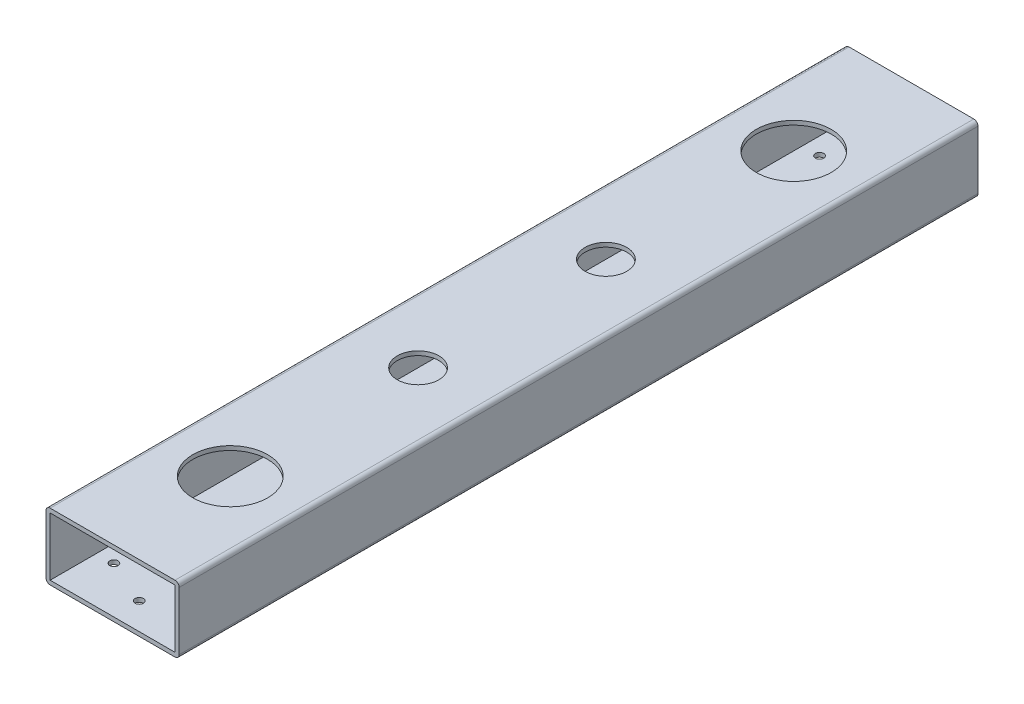
ISO-10303-21;
HEADER;
FILE_DESCRIPTION(('STEP AP214'),'2;1');
FILE_NAME('part.step','',(''),(''),'','','');
FILE_SCHEMA(('AUTOMOTIVE_DESIGN { 1 0 10303 214 1 1 1 1 }'));
ENDSEC;
DATA;
#1=APPLICATION_CONTEXT('core data for automotive mechanical design processes');
#2=APPLICATION_PROTOCOL_DEFINITION('international standard','automotive_design',2000,#1);
#3=PRODUCT_CONTEXT('',#1,'mechanical');
#4=PRODUCT('Part','Part','',(#3));
#5=PRODUCT_RELATED_PRODUCT_CATEGORY('part','',(#4));
#6=PRODUCT_DEFINITION_FORMATION('','',#4);
#7=PRODUCT_DEFINITION_CONTEXT('part definition',#1,'design');
#8=PRODUCT_DEFINITION('design','',#6,#7);
#9=PRODUCT_DEFINITION_SHAPE('','',#8);
#10=(LENGTH_UNIT() NAMED_UNIT(*) SI_UNIT(.MILLI.,.METRE.));
#11=(NAMED_UNIT(*) PLANE_ANGLE_UNIT() SI_UNIT($,.RADIAN.));
#12=(NAMED_UNIT(*) SI_UNIT($,.STERADIAN.) SOLID_ANGLE_UNIT());
#13=UNCERTAINTY_MEASURE_WITH_UNIT(LENGTH_MEASURE(1.E-05),#10,'distance_accuracy_value','');
#14=(GEOMETRIC_REPRESENTATION_CONTEXT(3) GLOBAL_UNCERTAINTY_ASSIGNED_CONTEXT((#13)) GLOBAL_UNIT_ASSIGNED_CONTEXT((#10,
#11,#12)) REPRESENTATION_CONTEXT('',''));
#15=CARTESIAN_POINT('',(0.,0.,0.));
#16=DIRECTION('',(0.,0.,1.));
#17=DIRECTION('',(1.,0.,0.));
#18=AXIS2_PLACEMENT_3D('',#15,#16,#17);
#19=CARTESIAN_POINT('',(-23.8125,-11.1125,304.8));
#20=DIRECTION('',(0.,0.,-1.));
#21=DIRECTION('',(-1.,0.,0.));
#22=AXIS2_PLACEMENT_3D('',#19,#20,#21);
#23=PLANE('',#22);
#24=CARTESIAN_POINT('',(-23.8125,-11.1125,304.8));
#25=DIRECTION('',(0.,0.,1.));
#26=DIRECTION('',(-1.,0.,0.));
#27=AXIS2_PLACEMENT_3D('',#24,#25,#26);
#28=CIRCLE('',#27,1.5875);
#29=CARTESIAN_POINT('',(-25.4,-11.1125,304.8));
#30=VERTEX_POINT('',#29);
#31=CARTESIAN_POINT('',(-23.8125,-12.7,304.8));
#32=VERTEX_POINT('',#31);
#33=EDGE_CURVE('E160',#30,#32,#28,.T.);
#34=ORIENTED_EDGE('',*,*,#33,.T.);
#35=DIRECTION('',(1.,0.,0.));
#36=VECTOR('',#35,1.);
#37=CARTESIAN_POINT('',(-23.8125,-12.7,304.8));
#38=LINE('',#37,#36);
#39=CARTESIAN_POINT('',(23.8125,-12.7,304.8));
#40=VERTEX_POINT('',#39);
#41=EDGE_CURVE('E163',#32,#40,#38,.T.);
#42=ORIENTED_EDGE('',*,*,#41,.T.);
#43=CARTESIAN_POINT('',(23.8125,-11.1125,304.8));
#44=DIRECTION('',(0.,0.,1.));
#45=DIRECTION('',(1.,0.,0.));
#46=AXIS2_PLACEMENT_3D('',#43,#44,#45);
#47=CIRCLE('',#46,1.5875);
#48=CARTESIAN_POINT('',(25.4,-11.1125,304.8));
#49=VERTEX_POINT('',#48);
#50=EDGE_CURVE('E166',#40,#49,#47,.T.);
#51=ORIENTED_EDGE('',*,*,#50,.T.);
#52=DIRECTION('',(0.,1.,0.));
#53=VECTOR('',#52,1.);
#54=CARTESIAN_POINT('',(25.4,-11.1125,304.8));
#55=LINE('',#54,#53);
#56=CARTESIAN_POINT('',(25.4,11.1125,304.8));
#57=VERTEX_POINT('',#56);
#58=EDGE_CURVE('E168',#49,#57,#55,.T.);
#59=ORIENTED_EDGE('',*,*,#58,.T.);
#60=CARTESIAN_POINT('',(23.8125,11.1125,304.8));
#61=DIRECTION('',(0.,0.,1.));
#62=DIRECTION('',(-1.,0.,0.));
#63=AXIS2_PLACEMENT_3D('',#60,#61,#62);
#64=CIRCLE('',#63,1.5875);
#65=CARTESIAN_POINT('',(23.8125,12.7,304.8));
#66=VERTEX_POINT('',#65);
#67=EDGE_CURVE('E170',#57,#66,#64,.T.);
#68=ORIENTED_EDGE('',*,*,#67,.T.);
#69=DIRECTION('',(-1.,0.,0.));
#70=VECTOR('',#69,1.);
#71=CARTESIAN_POINT('',(-23.8125,12.7,304.8));
#72=LINE('',#71,#70);
#73=CARTESIAN_POINT('',(-23.8125,12.7,304.8));
#74=VERTEX_POINT('',#73);
#75=EDGE_CURVE('E172',#66,#74,#72,.T.);
#76=ORIENTED_EDGE('',*,*,#75,.T.);
#77=CARTESIAN_POINT('',(-23.8125,11.1125,304.8));
#78=DIRECTION('',(0.,0.,1.));
#79=DIRECTION('',(-1.,0.,0.));
#80=AXIS2_PLACEMENT_3D('',#77,#78,#79);
#81=CIRCLE('',#80,1.5875);
#82=CARTESIAN_POINT('',(-25.4,11.1125,304.8));
#83=VERTEX_POINT('',#82);
#84=EDGE_CURVE('E174',#74,#83,#81,.T.);
#85=ORIENTED_EDGE('',*,*,#84,.T.);
#86=DIRECTION('',(0.,-1.,0.));
#87=VECTOR('',#86,1.);
#88=CARTESIAN_POINT('',(-25.4,-11.1125,304.8));
#89=LINE('',#88,#87);
#90=EDGE_CURVE('E176',#83,#30,#89,.T.);
#91=ORIENTED_EDGE('',*,*,#90,.T.);
#92=EDGE_LOOP('',(#34,#42,#51,#59,#68,#76,#85,#91));
#93=FACE_BOUND('',#92,.T.);
#94=DIRECTION('',(0.,-1.,0.));
#95=VECTOR('',#94,1.);
#96=CARTESIAN_POINT('',(-23.8125,-11.1125,304.8));
#97=LINE('',#96,#95);
#98=CARTESIAN_POINT('',(-23.8125,11.1125,304.8));
#99=VERTEX_POINT('',#98);
#100=CARTESIAN_POINT('',(-23.8125,-11.1125,304.8));
#101=VERTEX_POINT('',#100);
#102=EDGE_CURVE('E122',#99,#101,#97,.T.);
#103=ORIENTED_EDGE('',*,*,#102,.F.);
#104=DIRECTION('',(-1.,0.,0.));
#105=VECTOR('',#104,1.);
#106=CARTESIAN_POINT('',(-23.8125,11.1125,304.8));
#107=LINE('',#106,#105);
#108=CARTESIAN_POINT('',(23.8125,11.1125,304.8));
#109=VERTEX_POINT('',#108);
#110=EDGE_CURVE('E144',#109,#99,#107,.T.);
#111=ORIENTED_EDGE('',*,*,#110,.F.);
#112=DIRECTION('',(0.,1.,0.));
#113=VECTOR('',#112,1.);
#114=CARTESIAN_POINT('',(23.8125,-11.1125,304.8));
#115=LINE('',#114,#113);
#116=CARTESIAN_POINT('',(23.8125,-11.1125,304.8));
#117=VERTEX_POINT('',#116);
#118=EDGE_CURVE('E142',#117,#109,#115,.T.);
#119=ORIENTED_EDGE('',*,*,#118,.F.);
#120=DIRECTION('',(1.,0.,0.));
#121=VECTOR('',#120,1.);
#122=CARTESIAN_POINT('',(-23.8125,-11.1125,304.8));
#123=LINE('',#122,#121);
#124=EDGE_CURVE('E130',#101,#117,#123,.T.);
#125=ORIENTED_EDGE('',*,*,#124,.F.);
#126=EDGE_LOOP('',(#103,#111,#119,#125));
#127=FACE_BOUND('',#126,.T.);
#128=ADVANCED_FACE('F33',(#93,#127),#23,.F.);
#129=CARTESIAN_POINT('',(-23.8125,-11.1125,0.));
#130=DIRECTION('',(0.,0.,-1.));
#131=DIRECTION('',(-1.,0.,0.));
#132=AXIS2_PLACEMENT_3D('',#129,#130,#131);
#133=PLANE('',#132);
#134=CARTESIAN_POINT('',(-23.8125,-11.1125,0.));
#135=DIRECTION('',(0.,0.,1.));
#136=DIRECTION('',(-1.,0.,0.));
#137=AXIS2_PLACEMENT_3D('',#134,#135,#136);
#138=CIRCLE('',#137,1.5875);
#139=CARTESIAN_POINT('',(-25.4,-11.1125,0.));
#140=VERTEX_POINT('',#139);
#141=CARTESIAN_POINT('',(-23.8125,-12.7,0.));
#142=VERTEX_POINT('',#141);
#143=EDGE_CURVE('E138',#140,#142,#138,.T.);
#144=ORIENTED_EDGE('',*,*,#143,.F.);
#145=DIRECTION('',(0.,-1.,0.));
#146=VECTOR('',#145,1.);
#147=CARTESIAN_POINT('',(-25.4,-11.1125,0.));
#148=LINE('',#147,#146);
#149=CARTESIAN_POINT('',(-25.4,11.1125,0.));
#150=VERTEX_POINT('',#149);
#151=EDGE_CURVE('E164',#150,#140,#148,.T.);
#152=ORIENTED_EDGE('',*,*,#151,.F.);
#153=CARTESIAN_POINT('',(-23.8125,11.1125,0.));
#154=DIRECTION('',(0.,0.,1.));
#155=DIRECTION('',(-1.,0.,0.));
#156=AXIS2_PLACEMENT_3D('',#153,#154,#155);
#157=CIRCLE('',#156,1.5875);
#158=CARTESIAN_POINT('',(-23.8125,12.7,0.));
#159=VERTEX_POINT('',#158);
#160=EDGE_CURVE('E191',#159,#150,#157,.T.);
#161=ORIENTED_EDGE('',*,*,#160,.F.);
#162=DIRECTION('',(-1.,0.,0.));
#163=VECTOR('',#162,1.);
#164=CARTESIAN_POINT('',(-23.8125,12.7,0.));
#165=LINE('',#164,#163);
#166=CARTESIAN_POINT('',(23.8125,12.7,0.));
#167=VERTEX_POINT('',#166);
#168=EDGE_CURVE('E189',#167,#159,#165,.T.);
#169=ORIENTED_EDGE('',*,*,#168,.F.);
#170=CARTESIAN_POINT('',(23.8125,11.1125,0.));
#171=DIRECTION('',(0.,0.,1.));
#172=DIRECTION('',(-1.,0.,0.));
#173=AXIS2_PLACEMENT_3D('',#170,#171,#172);
#174=CIRCLE('',#173,1.5875);
#175=CARTESIAN_POINT('',(25.4,11.1125,0.));
#176=VERTEX_POINT('',#175);
#177=EDGE_CURVE('E187',#176,#167,#174,.T.);
#178=ORIENTED_EDGE('',*,*,#177,.F.);
#179=DIRECTION('',(0.,1.,0.));
#180=VECTOR('',#179,1.);
#181=CARTESIAN_POINT('',(25.4,-11.1125,0.));
#182=LINE('',#181,#180);
#183=CARTESIAN_POINT('',(25.4,-11.1125,0.));
#184=VERTEX_POINT('',#183);
#185=EDGE_CURVE('E185',#184,#176,#182,.T.);
#186=ORIENTED_EDGE('',*,*,#185,.F.);
#187=CARTESIAN_POINT('',(23.8125,-11.1125,0.));
#188=DIRECTION('',(0.,0.,1.));
#189=DIRECTION('',(1.,0.,0.));
#190=AXIS2_PLACEMENT_3D('',#187,#188,#189);
#191=CIRCLE('',#190,1.5875);
#192=CARTESIAN_POINT('',(23.8125,-12.7,0.));
#193=VERTEX_POINT('',#192);
#194=EDGE_CURVE('E183',#193,#184,#191,.T.);
#195=ORIENTED_EDGE('',*,*,#194,.F.);
#196=DIRECTION('',(1.,0.,0.));
#197=VECTOR('',#196,1.);
#198=CARTESIAN_POINT('',(-23.8125,-12.7,0.));
#199=LINE('',#198,#197);
#200=EDGE_CURVE('E181',#142,#193,#199,.T.);
#201=ORIENTED_EDGE('',*,*,#200,.F.);
#202=EDGE_LOOP('',(#144,#152,#161,#169,#178,#186,#195,#201));
#203=FACE_BOUND('',#202,.T.);
#204=DIRECTION('',(-1.,0.,0.));
#205=VECTOR('',#204,1.);
#206=CARTESIAN_POINT('',(-23.8125,11.1125,0.));
#207=LINE('',#206,#205);
#208=CARTESIAN_POINT('',(23.8125,11.1125,0.));
#209=VERTEX_POINT('',#208);
#210=CARTESIAN_POINT('',(-23.8125,11.1125,0.));
#211=VERTEX_POINT('',#210);
#212=EDGE_CURVE('E131',#209,#211,#207,.T.);
#213=ORIENTED_EDGE('',*,*,#212,.T.);
#214=DIRECTION('',(0.,-1.,0.));
#215=VECTOR('',#214,1.);
#216=CARTESIAN_POINT('',(-23.8125,-11.1125,0.));
#217=LINE('',#216,#215);
#218=CARTESIAN_POINT('',(-23.8125,-11.1125,0.));
#219=VERTEX_POINT('',#218);
#220=EDGE_CURVE('E56',#211,#219,#217,.T.);
#221=ORIENTED_EDGE('',*,*,#220,.T.);
#222=DIRECTION('',(1.,0.,0.));
#223=VECTOR('',#222,1.);
#224=CARTESIAN_POINT('',(-23.8125,-11.1125,0.));
#225=LINE('',#224,#223);
#226=CARTESIAN_POINT('',(23.8125,-11.1125,0.));
#227=VERTEX_POINT('',#226);
#228=EDGE_CURVE('E137',#219,#227,#225,.T.);
#229=ORIENTED_EDGE('',*,*,#228,.T.);
#230=DIRECTION('',(0.,1.,0.));
#231=VECTOR('',#230,1.);
#232=CARTESIAN_POINT('',(23.8125,-11.1125,0.));
#233=LINE('',#232,#231);
#234=EDGE_CURVE('E152',#227,#209,#233,.T.);
#235=ORIENTED_EDGE('',*,*,#234,.T.);
#236=EDGE_LOOP('',(#213,#221,#229,#235));
#237=FACE_BOUND('',#236,.T.);
#238=ADVANCED_FACE('F221',(#203,#237),#133,.T.);
#239=CARTESIAN_POINT('',(-23.8125,-11.1125,304.8));
#240=DIRECTION('',(0.,0.,-1.));
#241=DIRECTION('',(-1.,0.,0.));
#242=AXIS2_PLACEMENT_3D('',#239,#240,#241);
#243=CYLINDRICAL_SURFACE('',#242,1.5875);
#244=ORIENTED_EDGE('',*,*,#143,.T.);
#245=DIRECTION('',(0.,0.,-1.));
#246=VECTOR('',#245,1.);
#247=CARTESIAN_POINT('',(-23.8125,-12.7,304.8));
#248=LINE('',#247,#246);
#249=EDGE_CURVE('E11',#32,#142,#248,.T.);
#250=ORIENTED_EDGE('',*,*,#249,.F.);
#251=ORIENTED_EDGE('',*,*,#33,.F.);
#252=DIRECTION('',(0.,0.,-1.));
#253=VECTOR('',#252,1.);
#254=CARTESIAN_POINT('',(-25.4,-11.1125,304.8));
#255=LINE('',#254,#253);
#256=EDGE_CURVE('E178',#30,#140,#255,.T.);
#257=ORIENTED_EDGE('',*,*,#256,.T.);
#258=EDGE_LOOP('',(#244,#250,#251,#257));
#259=FACE_BOUND('',#258,.T.);
#260=ADVANCED_FACE('F35',(#259),#243,.T.);
#261=CARTESIAN_POINT('',(-23.8125,-12.7,304.8));
#262=DIRECTION('',(0.,1.,0.));
#263=DIRECTION('',(0.,0.,1.));
#264=AXIS2_PLACEMENT_3D('',#261,#262,#263);
#265=PLANE('',#264);
#266=CARTESIAN_POINT('',(17.272,-12.7,17.7800000000011));
#267=DIRECTION('',(0.,1.,0.));
#268=DIRECTION('',(0.,0.,1.));
#269=AXIS2_PLACEMENT_3D('',#266,#267,#268);
#270=CIRCLE('',#269,1.5875);
#271=CARTESIAN_POINT('',(17.272,-12.7,19.3675000000011));
#272=VERTEX_POINT('',#271);
#273=EDGE_CURVE('E374',#272,#272,#270,.F.);
#274=ORIENTED_EDGE('',*,*,#273,.F.);
#275=EDGE_LOOP('',(#274));
#276=FACE_BOUND('',#275,.T.);
#277=CARTESIAN_POINT('',(0.,-12.7,10.1600000000011));
#278=DIRECTION('',(0.,1.,0.));
#279=DIRECTION('',(0.,0.,1.));
#280=AXIS2_PLACEMENT_3D('',#277,#278,#279);
#281=CIRCLE('',#280,1.5875);
#282=CARTESIAN_POINT('',(0.,-12.7,11.7475000000011));
#283=VERTEX_POINT('',#282);
#284=EDGE_CURVE('E371',#283,#283,#281,.F.);
#285=ORIENTED_EDGE('',*,*,#284,.F.);
#286=EDGE_LOOP('',(#285));
#287=FACE_BOUND('',#286,.T.);
#288=CARTESIAN_POINT('',(-17.272,-12.7,17.7800000000011));
#289=DIRECTION('',(0.,1.,0.));
#290=DIRECTION('',(0.,0.,1.));
#291=AXIS2_PLACEMENT_3D('',#288,#289,#290);
#292=CIRCLE('',#291,1.5875);
#293=CARTESIAN_POINT('',(-17.272,-12.7,19.3675000000011));
#294=VERTEX_POINT('',#293);
#295=EDGE_CURVE('E362',#294,#294,#292,.F.);
#296=ORIENTED_EDGE('',*,*,#295,.F.);
#297=EDGE_LOOP('',(#296));
#298=FACE_BOUND('',#297,.T.);
#299=CARTESIAN_POINT('',(-17.2719999999999,-12.7,287.02));
#300=DIRECTION('',(0.,1.,0.));
#301=DIRECTION('',(0.,0.,1.));
#302=AXIS2_PLACEMENT_3D('',#299,#300,#301);
#303=CIRCLE('',#302,1.58749999999986);
#304=CARTESIAN_POINT('',(-17.2719999999999,-12.7,288.6075));
#305=VERTEX_POINT('',#304);
#306=EDGE_CURVE('E358',#305,#305,#303,.F.);
#307=ORIENTED_EDGE('',*,*,#306,.F.);
#308=EDGE_LOOP('',(#307));
#309=FACE_BOUND('',#308,.T.);
#310=CARTESIAN_POINT('',(1.11022302462516E-13,-12.7,294.64));
#311=DIRECTION('',(0.,1.,0.));
#312=DIRECTION('',(0.,0.,1.));
#313=AXIS2_PLACEMENT_3D('',#310,#311,#312);
#314=CIRCLE('',#313,1.58749999999974);
#315=CARTESIAN_POINT('',(1.11022302462516E-13,-12.7,296.2275));
#316=VERTEX_POINT('',#315);
#317=EDGE_CURVE('E356',#316,#316,#314,.F.);
#318=ORIENTED_EDGE('',*,*,#317,.F.);
#319=EDGE_LOOP('',(#318));
#320=FACE_BOUND('',#319,.T.);
#321=CARTESIAN_POINT('',(17.2720000000001,-12.7,287.02));
#322=DIRECTION('',(0.,1.,0.));
#323=DIRECTION('',(0.,0.,1.));
#324=AXIS2_PLACEMENT_3D('',#321,#322,#323);
#325=CIRCLE('',#324,1.58749999999986);
#326=CARTESIAN_POINT('',(17.2720000000001,-12.7,288.6075));
#327=VERTEX_POINT('',#326);
#328=EDGE_CURVE('E359',#327,#327,#325,.F.);
#329=ORIENTED_EDGE('',*,*,#328,.F.);
#330=EDGE_LOOP('',(#329));
#331=FACE_BOUND('',#330,.T.);
#332=CARTESIAN_POINT('',(0.,-12.7,188.233332818));
#333=DIRECTION('',(0.,1.,0.));
#334=DIRECTION('',(0.,0.,1.));
#335=AXIS2_PLACEMENT_3D('',#332,#333,#334);
#336=CIRCLE('',#335,3.37819999999999);
#337=CARTESIAN_POINT('',(0.,-12.7,191.611532818));
#338=VERTEX_POINT('',#337);
#339=EDGE_CURVE('E398',#338,#338,#336,.F.);
#340=ORIENTED_EDGE('',*,*,#339,.F.);
#341=EDGE_LOOP('',(#340));
#342=FACE_BOUND('',#341,.T.);
#343=CARTESIAN_POINT('',(0.,-12.7,116.566667182));
#344=DIRECTION('',(0.,1.,0.));
#345=DIRECTION('',(0.,0.,1.));
#346=AXIS2_PLACEMENT_3D('',#343,#344,#345);
#347=CIRCLE('',#346,3.37819999999999);
#348=CARTESIAN_POINT('',(0.,-12.7,119.944867182));
#349=VERTEX_POINT('',#348);
#350=EDGE_CURVE('E393',#349,#349,#347,.F.);
#351=ORIENTED_EDGE('',*,*,#350,.F.);
#352=EDGE_LOOP('',(#351));
#353=FACE_BOUND('',#352,.T.);
#354=CARTESIAN_POINT('',(0.,-12.7,44.9));
#355=DIRECTION('',(0.,1.,0.));
#356=DIRECTION('',(0.,0.,1.));
#357=AXIS2_PLACEMENT_3D('',#354,#355,#356);
#358=CIRCLE('',#357,12.7);
#359=CARTESIAN_POINT('',(0.,-12.7,57.6));
#360=VERTEX_POINT('',#359);
#361=EDGE_CURVE('E410',#360,#360,#358,.F.);
#362=ORIENTED_EDGE('',*,*,#361,.F.);
#363=EDGE_LOOP('',(#362));
#364=FACE_BOUND('',#363,.T.);
#365=CARTESIAN_POINT('',(0.,-12.7,259.9));
#366=DIRECTION('',(0.,1.,0.));
#367=DIRECTION('',(0.,0.,1.));
#368=AXIS2_PLACEMENT_3D('',#365,#366,#367);
#369=CIRCLE('',#368,12.7);
#370=CARTESIAN_POINT('',(0.,-12.7,272.6));
#371=VERTEX_POINT('',#370);
#372=EDGE_CURVE('E405',#371,#371,#369,.F.);
#373=ORIENTED_EDGE('',*,*,#372,.F.);
#374=EDGE_LOOP('',(#373));
#375=FACE_BOUND('',#374,.T.);
#376=ORIENTED_EDGE('',*,*,#200,.T.);
#377=DIRECTION('',(0.,0.,-1.));
#378=VECTOR('',#377,1.);
#379=CARTESIAN_POINT('',(23.8125,-12.7,304.8));
#380=LINE('',#379,#378);
#381=EDGE_CURVE('E41',#40,#193,#380,.T.);
#382=ORIENTED_EDGE('',*,*,#381,.F.);
#383=ORIENTED_EDGE('',*,*,#41,.F.);
#384=ORIENTED_EDGE('',*,*,#249,.T.);
#385=EDGE_LOOP('',(#376,#382,#383,#384));
#386=FACE_BOUND('',#385,.T.);
#387=ADVANCED_FACE('F238',(#276,#287,#298,#309,#320,#331,#342,#353,#364,#375,#386),#265,.F.);
#388=CARTESIAN_POINT('',(23.8125,-11.1125,304.8));
#389=DIRECTION('',(0.,0.,-1.));
#390=DIRECTION('',(-1.,0.,0.));
#391=AXIS2_PLACEMENT_3D('',#388,#389,#390);
#392=CYLINDRICAL_SURFACE('',#391,1.5875);
#393=ORIENTED_EDGE('',*,*,#194,.T.);
#394=DIRECTION('',(0.,0.,-1.));
#395=VECTOR('',#394,1.);
#396=CARTESIAN_POINT('',(25.4,-11.1125,304.8));
#397=LINE('',#396,#395);
#398=EDGE_CURVE('E208',#49,#184,#397,.T.);
#399=ORIENTED_EDGE('',*,*,#398,.F.);
#400=ORIENTED_EDGE('',*,*,#50,.F.);
#401=ORIENTED_EDGE('',*,*,#381,.T.);
#402=EDGE_LOOP('',(#393,#399,#400,#401));
#403=FACE_BOUND('',#402,.T.);
#404=ADVANCED_FACE('F215',(#403),#392,.T.);
#405=CARTESIAN_POINT('',(25.4,-11.1125,304.8));
#406=DIRECTION('',(-1.,0.,0.));
#407=DIRECTION('',(0.,0.,1.));
#408=AXIS2_PLACEMENT_3D('',#405,#406,#407);
#409=PLANE('',#408);
#410=ORIENTED_EDGE('',*,*,#185,.T.);
#411=DIRECTION('',(0.,0.,-1.));
#412=VECTOR('',#411,1.);
#413=CARTESIAN_POINT('',(25.4,11.1125,304.8));
#414=LINE('',#413,#412);
#415=EDGE_CURVE('E205',#57,#176,#414,.T.);
#416=ORIENTED_EDGE('',*,*,#415,.F.);
#417=ORIENTED_EDGE('',*,*,#58,.F.);
#418=ORIENTED_EDGE('',*,*,#398,.T.);
#419=EDGE_LOOP('',(#410,#416,#417,#418));
#420=FACE_BOUND('',#419,.T.);
#421=ADVANCED_FACE('F227',(#420),#409,.F.);
#422=CARTESIAN_POINT('',(23.8125,11.1125,304.8));
#423=DIRECTION('',(0.,0.,-1.));
#424=DIRECTION('',(-1.,0.,0.));
#425=AXIS2_PLACEMENT_3D('',#422,#423,#424);
#426=CYLINDRICAL_SURFACE('',#425,1.5875);
#427=ORIENTED_EDGE('',*,*,#177,.T.);
#428=DIRECTION('',(0.,0.,-1.));
#429=VECTOR('',#428,1.);
#430=CARTESIAN_POINT('',(23.8125,12.7,304.8));
#431=LINE('',#430,#429);
#432=EDGE_CURVE('E202',#66,#167,#431,.T.);
#433=ORIENTED_EDGE('',*,*,#432,.F.);
#434=ORIENTED_EDGE('',*,*,#67,.F.);
#435=ORIENTED_EDGE('',*,*,#415,.T.);
#436=EDGE_LOOP('',(#427,#433,#434,#435));
#437=FACE_BOUND('',#436,.T.);
#438=ADVANCED_FACE('F231',(#437),#426,.T.);
#439=CARTESIAN_POINT('',(-23.8125,12.7,304.8));
#440=DIRECTION('',(0.,-1.,0.));
#441=DIRECTION('',(0.,0.,-1.));
#442=AXIS2_PLACEMENT_3D('',#439,#440,#441);
#443=PLANE('',#442);
#444=CARTESIAN_POINT('',(0.,12.7,188.233332818));
#445=DIRECTION('',(0.,-1.,0.));
#446=DIRECTION('',(0.,0.,-1.));
#447=AXIS2_PLACEMENT_3D('',#444,#445,#446);
#448=CIRCLE('',#447,7.93749999999999);
#449=CARTESIAN_POINT('',(0.,12.7,180.295832818));
#450=VERTEX_POINT('',#449);
#451=EDGE_CURVE('E386',#450,#450,#448,.F.);
#452=ORIENTED_EDGE('',*,*,#451,.F.);
#453=EDGE_LOOP('',(#452));
#454=FACE_BOUND('',#453,.T.);
#455=CARTESIAN_POINT('',(0.,12.7,116.566667182));
#456=DIRECTION('',(0.,-1.,0.));
#457=DIRECTION('',(0.,0.,-1.));
#458=AXIS2_PLACEMENT_3D('',#455,#456,#457);
#459=CIRCLE('',#458,7.93750000000001);
#460=CARTESIAN_POINT('',(0.,12.7,108.629167182));
#461=VERTEX_POINT('',#460);
#462=EDGE_CURVE('E381',#461,#461,#459,.F.);
#463=ORIENTED_EDGE('',*,*,#462,.F.);
#464=EDGE_LOOP('',(#463));
#465=FACE_BOUND('',#464,.T.);
#466=CARTESIAN_POINT('',(0.,12.7,259.9));
#467=DIRECTION('',(0.,-1.,0.));
#468=DIRECTION('',(0.,0.,-1.));
#469=AXIS2_PLACEMENT_3D('',#466,#467,#468);
#470=CIRCLE('',#469,14.2875);
#471=CARTESIAN_POINT('',(0.,12.7,245.6125));
#472=VERTEX_POINT('',#471);
#473=EDGE_CURVE('E150',#472,#472,#470,.F.);
#474=ORIENTED_EDGE('',*,*,#473,.F.);
#475=EDGE_LOOP('',(#474));
#476=FACE_BOUND('',#475,.T.);
#477=CARTESIAN_POINT('',(0.,12.7,44.9));
#478=DIRECTION('',(0.,-1.,0.));
#479=DIRECTION('',(0.,0.,-1.));
#480=AXIS2_PLACEMENT_3D('',#477,#478,#479);
#481=CIRCLE('',#480,14.2875);
#482=CARTESIAN_POINT('',(0.,12.7,30.6125));
#483=VERTEX_POINT('',#482);
#484=EDGE_CURVE('E417',#483,#483,#481,.F.);
#485=ORIENTED_EDGE('',*,*,#484,.F.);
#486=EDGE_LOOP('',(#485));
#487=FACE_BOUND('',#486,.T.);
#488=ORIENTED_EDGE('',*,*,#168,.T.);
#489=DIRECTION('',(0.,0.,-1.));
#490=VECTOR('',#489,1.);
#491=CARTESIAN_POINT('',(-23.8125,12.7,304.8));
#492=LINE('',#491,#490);
#493=EDGE_CURVE('E199',#74,#159,#492,.T.);
#494=ORIENTED_EDGE('',*,*,#493,.F.);
#495=ORIENTED_EDGE('',*,*,#75,.F.);
#496=ORIENTED_EDGE('',*,*,#432,.T.);
#497=EDGE_LOOP('',(#488,#494,#495,#496));
#498=FACE_BOUND('',#497,.T.);
#499=ADVANCED_FACE('F251',(#454,#465,#476,#487,#498),#443,.F.);
#500=CARTESIAN_POINT('',(-23.8125,11.1125,304.8));
#501=DIRECTION('',(0.,0.,-1.));
#502=DIRECTION('',(-1.,0.,0.));
#503=AXIS2_PLACEMENT_3D('',#500,#501,#502);
#504=CYLINDRICAL_SURFACE('',#503,1.5875);
#505=ORIENTED_EDGE('',*,*,#160,.T.);
#506=DIRECTION('',(0.,0.,-1.));
#507=VECTOR('',#506,1.);
#508=CARTESIAN_POINT('',(-25.4,11.1125,304.8));
#509=LINE('',#508,#507);
#510=EDGE_CURVE('E196',#83,#150,#509,.T.);
#511=ORIENTED_EDGE('',*,*,#510,.F.);
#512=ORIENTED_EDGE('',*,*,#84,.F.);
#513=ORIENTED_EDGE('',*,*,#493,.T.);
#514=EDGE_LOOP('',(#505,#511,#512,#513));
#515=FACE_BOUND('',#514,.T.);
#516=ADVANCED_FACE('F249',(#515),#504,.T.);
#517=CARTESIAN_POINT('',(-25.4,-11.1125,304.8));
#518=DIRECTION('',(1.,0.,0.));
#519=DIRECTION('',(0.,0.,-1.));
#520=AXIS2_PLACEMENT_3D('',#517,#518,#519);
#521=PLANE('',#520);
#522=ORIENTED_EDGE('',*,*,#151,.T.);
#523=ORIENTED_EDGE('',*,*,#256,.F.);
#524=ORIENTED_EDGE('',*,*,#90,.F.);
#525=ORIENTED_EDGE('',*,*,#510,.T.);
#526=EDGE_LOOP('',(#522,#523,#524,#525));
#527=FACE_BOUND('',#526,.T.);
#528=ADVANCED_FACE('F244',(#527),#521,.F.);
#529=CARTESIAN_POINT('',(-23.8125,-11.1125,304.8));
#530=DIRECTION('',(1.,0.,0.));
#531=DIRECTION('',(0.,0.,-1.));
#532=AXIS2_PLACEMENT_3D('',#529,#530,#531);
#533=PLANE('',#532);
#534=ORIENTED_EDGE('',*,*,#220,.F.);
#535=DIRECTION('',(0.,0.,-1.));
#536=VECTOR('',#535,1.);
#537=CARTESIAN_POINT('',(-23.8125,11.1125,304.8));
#538=LINE('',#537,#536);
#539=EDGE_CURVE('E126',#99,#211,#538,.T.);
#540=ORIENTED_EDGE('',*,*,#539,.F.);
#541=ORIENTED_EDGE('',*,*,#102,.T.);
#542=DIRECTION('',(0.,0.,-1.));
#543=VECTOR('',#542,1.);
#544=CARTESIAN_POINT('',(-23.8125,-11.1125,304.8));
#545=LINE('',#544,#543);
#546=EDGE_CURVE('E125',#101,#219,#545,.T.);
#547=ORIENTED_EDGE('',*,*,#546,.T.);
#548=EDGE_LOOP('',(#534,#540,#541,#547));
#549=FACE_BOUND('',#548,.T.);
#550=ADVANCED_FACE('F124',(#549),#533,.T.);
#551=CARTESIAN_POINT('',(-23.8125,-11.1125,304.8));
#552=DIRECTION('',(0.,1.,0.));
#553=DIRECTION('',(0.,0.,1.));
#554=AXIS2_PLACEMENT_3D('',#551,#552,#553);
#555=PLANE('',#554);
#556=CARTESIAN_POINT('',(17.272,-11.1125,17.7800000000011));
#557=DIRECTION('',(0.,1.,0.));
#558=DIRECTION('',(0.,0.,1.));
#559=AXIS2_PLACEMENT_3D('',#556,#557,#558);
#560=CIRCLE('',#559,1.5875);
#561=CARTESIAN_POINT('',(17.272,-11.1125,19.3675000000011));
#562=VERTEX_POINT('',#561);
#563=EDGE_CURVE('E638',#562,#562,#560,.F.);
#564=ORIENTED_EDGE('',*,*,#563,.T.);
#565=EDGE_LOOP('',(#564));
#566=FACE_BOUND('',#565,.T.);
#567=CARTESIAN_POINT('',(0.,-11.1125,10.1600000000011));
#568=DIRECTION('',(0.,1.,0.));
#569=DIRECTION('',(0.,0.,1.));
#570=AXIS2_PLACEMENT_3D('',#567,#568,#569);
#571=CIRCLE('',#570,1.5875);
#572=CARTESIAN_POINT('',(0.,-11.1125,11.7475000000011));
#573=VERTEX_POINT('',#572);
#574=EDGE_CURVE('E640',#573,#573,#571,.F.);
#575=ORIENTED_EDGE('',*,*,#574,.T.);
#576=EDGE_LOOP('',(#575));
#577=FACE_BOUND('',#576,.T.);
#578=CARTESIAN_POINT('',(-17.272,-11.1125,17.7800000000011));
#579=DIRECTION('',(0.,1.,0.));
#580=DIRECTION('',(0.,0.,1.));
#581=AXIS2_PLACEMENT_3D('',#578,#579,#580);
#582=CIRCLE('',#581,1.5875);
#583=CARTESIAN_POINT('',(-17.272,-11.1125,19.3675000000011));
#584=VERTEX_POINT('',#583);
#585=EDGE_CURVE('E643',#584,#584,#582,.F.);
#586=ORIENTED_EDGE('',*,*,#585,.T.);
#587=EDGE_LOOP('',(#586));
#588=FACE_BOUND('',#587,.T.);
#589=CARTESIAN_POINT('',(-17.2719999999999,-11.1125,287.02));
#590=DIRECTION('',(0.,1.,0.));
#591=DIRECTION('',(0.,0.,1.));
#592=AXIS2_PLACEMENT_3D('',#589,#590,#591);
#593=CIRCLE('',#592,1.58749999999986);
#594=CARTESIAN_POINT('',(-17.2719999999999,-11.1125,288.6075));
#595=VERTEX_POINT('',#594);
#596=EDGE_CURVE('E646',#595,#595,#593,.F.);
#597=ORIENTED_EDGE('',*,*,#596,.T.);
#598=EDGE_LOOP('',(#597));
#599=FACE_BOUND('',#598,.T.);
#600=CARTESIAN_POINT('',(1.11022302462516E-13,-11.1125,294.64));
#601=DIRECTION('',(0.,1.,0.));
#602=DIRECTION('',(0.,0.,1.));
#603=AXIS2_PLACEMENT_3D('',#600,#601,#602);
#604=CIRCLE('',#603,1.58749999999974);
#605=CARTESIAN_POINT('',(1.11022302462516E-13,-11.1125,296.2275));
#606=VERTEX_POINT('',#605);
#607=EDGE_CURVE('E353',#606,#606,#604,.F.);
#608=ORIENTED_EDGE('',*,*,#607,.T.);
#609=EDGE_LOOP('',(#608));
#610=FACE_BOUND('',#609,.T.);
#611=CARTESIAN_POINT('',(17.2720000000001,-11.1125,287.02));
#612=DIRECTION('',(0.,1.,0.));
#613=DIRECTION('',(0.,0.,1.));
#614=AXIS2_PLACEMENT_3D('',#611,#612,#613);
#615=CIRCLE('',#614,1.58749999999986);
#616=CARTESIAN_POINT('',(17.2720000000001,-11.1125,288.6075));
#617=VERTEX_POINT('',#616);
#618=EDGE_CURVE('E365',#617,#617,#615,.F.);
#619=ORIENTED_EDGE('',*,*,#618,.T.);
#620=EDGE_LOOP('',(#619));
#621=FACE_BOUND('',#620,.T.);
#622=CARTESIAN_POINT('',(0.,-11.1125,188.233332818));
#623=DIRECTION('',(0.,1.,0.));
#624=DIRECTION('',(0.,0.,1.));
#625=AXIS2_PLACEMENT_3D('',#622,#623,#624);
#626=CIRCLE('',#625,3.37819999999999);
#627=CARTESIAN_POINT('',(0.,-11.1125,191.611532818));
#628=VERTEX_POINT('',#627);
#629=EDGE_CURVE('E390',#628,#628,#626,.F.);
#630=ORIENTED_EDGE('',*,*,#629,.T.);
#631=EDGE_LOOP('',(#630));
#632=FACE_BOUND('',#631,.T.);
#633=CARTESIAN_POINT('',(0.,-11.1125,116.566667182));
#634=DIRECTION('',(0.,1.,0.));
#635=DIRECTION('',(0.,0.,1.));
#636=AXIS2_PLACEMENT_3D('',#633,#634,#635);
#637=CIRCLE('',#636,3.37819999999999);
#638=CARTESIAN_POINT('',(0.,-11.1125,119.944867182));
#639=VERTEX_POINT('',#638);
#640=EDGE_CURVE('E389',#639,#639,#637,.F.);
#641=ORIENTED_EDGE('',*,*,#640,.T.);
#642=EDGE_LOOP('',(#641));
#643=FACE_BOUND('',#642,.T.);
#644=CARTESIAN_POINT('',(0.,-11.1125,44.9));
#645=DIRECTION('',(0.,1.,0.));
#646=DIRECTION('',(0.,0.,1.));
#647=AXIS2_PLACEMENT_3D('',#644,#645,#646);
#648=CIRCLE('',#647,12.7);
#649=CARTESIAN_POINT('',(0.,-11.1125,57.6));
#650=VERTEX_POINT('',#649);
#651=EDGE_CURVE('E402',#650,#650,#648,.F.);
#652=ORIENTED_EDGE('',*,*,#651,.T.);
#653=EDGE_LOOP('',(#652));
#654=FACE_BOUND('',#653,.T.);
#655=CARTESIAN_POINT('',(0.,-11.1125,259.9));
#656=DIRECTION('',(0.,1.,0.));
#657=DIRECTION('',(0.,0.,1.));
#658=AXIS2_PLACEMENT_3D('',#655,#656,#657);
#659=CIRCLE('',#658,12.7);
#660=CARTESIAN_POINT('',(0.,-11.1125,272.6));
#661=VERTEX_POINT('',#660);
#662=EDGE_CURVE('E401',#661,#661,#659,.F.);
#663=ORIENTED_EDGE('',*,*,#662,.T.);
#664=EDGE_LOOP('',(#663));
#665=FACE_BOUND('',#664,.T.);
#666=ORIENTED_EDGE('',*,*,#228,.F.);
#667=ORIENTED_EDGE('',*,*,#546,.F.);
#668=ORIENTED_EDGE('',*,*,#124,.T.);
#669=DIRECTION('',(0.,0.,-1.));
#670=VECTOR('',#669,1.);
#671=CARTESIAN_POINT('',(23.8125,-11.1125,304.8));
#672=LINE('',#671,#670);
#673=EDGE_CURVE('E139',#117,#227,#672,.T.);
#674=ORIENTED_EDGE('',*,*,#673,.T.);
#675=EDGE_LOOP('',(#666,#667,#668,#674));
#676=FACE_BOUND('',#675,.T.);
#677=ADVANCED_FACE('F134',(#566,#577,#588,#599,#610,#621,#632,#643,#654,#665,#676),#555,.T.);
#678=CARTESIAN_POINT('',(23.8125,-11.1125,304.8));
#679=DIRECTION('',(-1.,0.,0.));
#680=DIRECTION('',(0.,-1.,0.));
#681=AXIS2_PLACEMENT_3D('',#678,#679,#680);
#682=PLANE('',#681);
#683=ORIENTED_EDGE('',*,*,#234,.F.);
#684=ORIENTED_EDGE('',*,*,#673,.F.);
#685=ORIENTED_EDGE('',*,*,#118,.T.);
#686=DIRECTION('',(0.,0.,-1.));
#687=VECTOR('',#686,1.);
#688=CARTESIAN_POINT('',(23.8125,11.1125,304.8));
#689=LINE('',#688,#687);
#690=EDGE_CURVE('E48',#109,#209,#689,.T.);
#691=ORIENTED_EDGE('',*,*,#690,.T.);
#692=EDGE_LOOP('',(#683,#684,#685,#691));
#693=FACE_BOUND('',#692,.T.);
#694=ADVANCED_FACE('F279',(#693),#682,.T.);
#695=CARTESIAN_POINT('',(-23.8125,11.1125,304.8));
#696=DIRECTION('',(0.,-1.,0.));
#697=DIRECTION('',(1.,0.,0.));
#698=AXIS2_PLACEMENT_3D('',#695,#696,#697);
#699=PLANE('',#698);
#700=CARTESIAN_POINT('',(0.,11.1125,188.233332818));
#701=DIRECTION('',(0.,-1.,0.));
#702=DIRECTION('',(1.,0.,0.));
#703=AXIS2_PLACEMENT_3D('',#700,#701,#702);
#704=CIRCLE('',#703,7.93749999999999);
#705=CARTESIAN_POINT('',(7.93749999999999,11.1125,188.233332818));
#706=VERTEX_POINT('',#705);
#707=EDGE_CURVE('E378',#706,#706,#704,.F.);
#708=ORIENTED_EDGE('',*,*,#707,.T.);
#709=EDGE_LOOP('',(#708));
#710=FACE_BOUND('',#709,.T.);
#711=CARTESIAN_POINT('',(0.,11.1125,116.566667182));
#712=DIRECTION('',(0.,-1.,0.));
#713=DIRECTION('',(1.,0.,0.));
#714=AXIS2_PLACEMENT_3D('',#711,#712,#713);
#715=CIRCLE('',#714,7.93750000000001);
#716=CARTESIAN_POINT('',(7.93750000000001,11.1125,116.566667182));
#717=VERTEX_POINT('',#716);
#718=EDGE_CURVE('E377',#717,#717,#715,.F.);
#719=ORIENTED_EDGE('',*,*,#718,.T.);
#720=EDGE_LOOP('',(#719));
#721=FACE_BOUND('',#720,.T.);
#722=CARTESIAN_POINT('',(0.,11.1125,259.9));
#723=DIRECTION('',(0.,-1.,0.));
#724=DIRECTION('',(1.,0.,0.));
#725=AXIS2_PLACEMENT_3D('',#722,#723,#724);
#726=CIRCLE('',#725,14.2875);
#727=CARTESIAN_POINT('',(14.2875,11.1125,259.9));
#728=VERTEX_POINT('',#727);
#729=EDGE_CURVE('E414',#728,#728,#726,.F.);
#730=ORIENTED_EDGE('',*,*,#729,.T.);
#731=EDGE_LOOP('',(#730));
#732=FACE_BOUND('',#731,.T.);
#733=CARTESIAN_POINT('',(0.,11.1125,44.9));
#734=DIRECTION('',(0.,-1.,0.));
#735=DIRECTION('',(1.,0.,0.));
#736=AXIS2_PLACEMENT_3D('',#733,#734,#735);
#737=CIRCLE('',#736,14.2875);
#738=CARTESIAN_POINT('',(14.2875,11.1125,44.9));
#739=VERTEX_POINT('',#738);
#740=EDGE_CURVE('E413',#739,#739,#737,.F.);
#741=ORIENTED_EDGE('',*,*,#740,.T.);
#742=EDGE_LOOP('',(#741));
#743=FACE_BOUND('',#742,.T.);
#744=ORIENTED_EDGE('',*,*,#212,.F.);
#745=ORIENTED_EDGE('',*,*,#690,.F.);
#746=ORIENTED_EDGE('',*,*,#110,.T.);
#747=ORIENTED_EDGE('',*,*,#539,.T.);
#748=EDGE_LOOP('',(#744,#745,#746,#747));
#749=FACE_BOUND('',#748,.T.);
#750=ADVANCED_FACE('F284',(#710,#721,#732,#743,#749),#699,.T.);
#751=CARTESIAN_POINT('',(0.,12.700012,44.9));
#752=DIRECTION('',(0.,-1.,0.));
#753=DIRECTION('',(0.,0.,-1.));
#754=AXIS2_PLACEMENT_3D('',#751,#752,#753);
#755=CYLINDRICAL_SURFACE('',#754,14.2875);
#756=ORIENTED_EDGE('',*,*,#740,.F.);
#757=EDGE_LOOP('',(#756));
#758=FACE_BOUND('',#757,.T.);
#759=ORIENTED_EDGE('',*,*,#484,.T.);
#760=EDGE_LOOP('',(#759));
#761=FACE_BOUND('',#760,.T.);
#762=ADVANCED_FACE('F292',(#758,#761),#755,.F.);
#763=CARTESIAN_POINT('',(0.,12.700012,259.9));
#764=DIRECTION('',(0.,-1.,0.));
#765=DIRECTION('',(0.,0.,-1.));
#766=AXIS2_PLACEMENT_3D('',#763,#764,#765);
#767=CYLINDRICAL_SURFACE('',#766,14.2875);
#768=ORIENTED_EDGE('',*,*,#729,.F.);
#769=EDGE_LOOP('',(#768));
#770=FACE_BOUND('',#769,.T.);
#771=ORIENTED_EDGE('',*,*,#473,.T.);
#772=EDGE_LOOP('',(#771));
#773=FACE_BOUND('',#772,.T.);
#774=ADVANCED_FACE('F296',(#770,#773),#767,.F.);
#775=CARTESIAN_POINT('',(0.,-12.700012,259.9));
#776=DIRECTION('',(0.,1.,0.));
#777=DIRECTION('',(0.,0.,1.));
#778=AXIS2_PLACEMENT_3D('',#775,#776,#777);
#779=CYLINDRICAL_SURFACE('',#778,12.7);
#780=ORIENTED_EDGE('',*,*,#662,.F.);
#781=EDGE_LOOP('',(#780));
#782=FACE_BOUND('',#781,.T.);
#783=ORIENTED_EDGE('',*,*,#372,.T.);
#784=EDGE_LOOP('',(#783));
#785=FACE_BOUND('',#784,.T.);
#786=ADVANCED_FACE('F300',(#782,#785),#779,.F.);
#787=CARTESIAN_POINT('',(0.,-12.700012,44.9));
#788=DIRECTION('',(0.,1.,0.));
#789=DIRECTION('',(0.,0.,1.));
#790=AXIS2_PLACEMENT_3D('',#787,#788,#789);
#791=CYLINDRICAL_SURFACE('',#790,12.7);
#792=ORIENTED_EDGE('',*,*,#651,.F.);
#793=EDGE_LOOP('',(#792));
#794=FACE_BOUND('',#793,.T.);
#795=ORIENTED_EDGE('',*,*,#361,.T.);
#796=EDGE_LOOP('',(#795));
#797=FACE_BOUND('',#796,.T.);
#798=ADVANCED_FACE('F304',(#794,#797),#791,.F.);
#799=CARTESIAN_POINT('',(0.,-12.700012,116.566667182));
#800=DIRECTION('',(0.,1.,0.));
#801=DIRECTION('',(0.,0.,1.));
#802=AXIS2_PLACEMENT_3D('',#799,#800,#801);
#803=CYLINDRICAL_SURFACE('',#802,3.37819999999999);
#804=ORIENTED_EDGE('',*,*,#640,.F.);
#805=EDGE_LOOP('',(#804));
#806=FACE_BOUND('',#805,.T.);
#807=ORIENTED_EDGE('',*,*,#350,.T.);
#808=EDGE_LOOP('',(#807));
#809=FACE_BOUND('',#808,.T.);
#810=ADVANCED_FACE('F308',(#806,#809),#803,.F.);
#811=CARTESIAN_POINT('',(0.,-12.700012,188.233332818));
#812=DIRECTION('',(0.,1.,0.));
#813=DIRECTION('',(0.,0.,1.));
#814=AXIS2_PLACEMENT_3D('',#811,#812,#813);
#815=CYLINDRICAL_SURFACE('',#814,3.37819999999999);
#816=ORIENTED_EDGE('',*,*,#629,.F.);
#817=EDGE_LOOP('',(#816));
#818=FACE_BOUND('',#817,.T.);
#819=ORIENTED_EDGE('',*,*,#339,.T.);
#820=EDGE_LOOP('',(#819));
#821=FACE_BOUND('',#820,.T.);
#822=ADVANCED_FACE('F312',(#818,#821),#815,.F.);
#823=CARTESIAN_POINT('',(0.,12.700012,116.566667182));
#824=DIRECTION('',(0.,-1.,0.));
#825=DIRECTION('',(0.,0.,-1.));
#826=AXIS2_PLACEMENT_3D('',#823,#824,#825);
#827=CYLINDRICAL_SURFACE('',#826,7.93750000000001);
#828=ORIENTED_EDGE('',*,*,#718,.F.);
#829=EDGE_LOOP('',(#828));
#830=FACE_BOUND('',#829,.T.);
#831=ORIENTED_EDGE('',*,*,#462,.T.);
#832=EDGE_LOOP('',(#831));
#833=FACE_BOUND('',#832,.T.);
#834=ADVANCED_FACE('F316',(#830,#833),#827,.F.);
#835=CARTESIAN_POINT('',(0.,12.700012,188.233332818));
#836=DIRECTION('',(0.,-1.,0.));
#837=DIRECTION('',(0.,0.,-1.));
#838=AXIS2_PLACEMENT_3D('',#835,#836,#837);
#839=CYLINDRICAL_SURFACE('',#838,7.93749999999999);
#840=ORIENTED_EDGE('',*,*,#707,.F.);
#841=EDGE_LOOP('',(#840));
#842=FACE_BOUND('',#841,.T.);
#843=ORIENTED_EDGE('',*,*,#451,.T.);
#844=EDGE_LOOP('',(#843));
#845=FACE_BOUND('',#844,.T.);
#846=ADVANCED_FACE('F320',(#842,#845),#839,.F.);
#847=CARTESIAN_POINT('',(17.2720000000001,-12.700012,287.02));
#848=DIRECTION('',(0.,1.,0.));
#849=DIRECTION('',(0.,0.,1.));
#850=AXIS2_PLACEMENT_3D('',#847,#848,#849);
#851=CYLINDRICAL_SURFACE('',#850,1.58749999999986);
#852=ORIENTED_EDGE('',*,*,#618,.F.);
#853=EDGE_LOOP('',(#852));
#854=FACE_BOUND('',#853,.T.);
#855=ORIENTED_EDGE('',*,*,#328,.T.);
#856=EDGE_LOOP('',(#855));
#857=FACE_BOUND('',#856,.T.);
#858=ADVANCED_FACE('F324',(#854,#857),#851,.F.);
#859=CARTESIAN_POINT('',(1.11022302462516E-13,-12.700012,294.64));
#860=DIRECTION('',(0.,1.,0.));
#861=DIRECTION('',(0.,0.,1.));
#862=AXIS2_PLACEMENT_3D('',#859,#860,#861);
#863=CYLINDRICAL_SURFACE('',#862,1.58749999999974);
#864=ORIENTED_EDGE('',*,*,#607,.F.);
#865=EDGE_LOOP('',(#864));
#866=FACE_BOUND('',#865,.T.);
#867=ORIENTED_EDGE('',*,*,#317,.T.);
#868=EDGE_LOOP('',(#867));
#869=FACE_BOUND('',#868,.T.);
#870=ADVANCED_FACE('F328',(#866,#869),#863,.F.);
#871=CARTESIAN_POINT('',(-17.2719999999999,-12.700012,287.02));
#872=DIRECTION('',(0.,1.,0.));
#873=DIRECTION('',(0.,0.,1.));
#874=AXIS2_PLACEMENT_3D('',#871,#872,#873);
#875=CYLINDRICAL_SURFACE('',#874,1.58749999999986);
#876=ORIENTED_EDGE('',*,*,#596,.F.);
#877=EDGE_LOOP('',(#876));
#878=FACE_BOUND('',#877,.T.);
#879=ORIENTED_EDGE('',*,*,#306,.T.);
#880=EDGE_LOOP('',(#879));
#881=FACE_BOUND('',#880,.T.);
#882=ADVANCED_FACE('F341',(#878,#881),#875,.F.);
#883=CARTESIAN_POINT('',(-17.272,-12.700012,17.7800000000011));
#884=DIRECTION('',(0.,1.,0.));
#885=DIRECTION('',(0.,0.,1.));
#886=AXIS2_PLACEMENT_3D('',#883,#884,#885);
#887=CYLINDRICAL_SURFACE('',#886,1.5875);
#888=ORIENTED_EDGE('',*,*,#585,.F.);
#889=EDGE_LOOP('',(#888));
#890=FACE_BOUND('',#889,.T.);
#891=ORIENTED_EDGE('',*,*,#295,.T.);
#892=EDGE_LOOP('',(#891));
#893=FACE_BOUND('',#892,.T.);
#894=ADVANCED_FACE('F337',(#890,#893),#887,.F.);
#895=CARTESIAN_POINT('',(0.,-12.700012,10.1600000000011));
#896=DIRECTION('',(0.,1.,0.));
#897=DIRECTION('',(0.,0.,1.));
#898=AXIS2_PLACEMENT_3D('',#895,#896,#897);
#899=CYLINDRICAL_SURFACE('',#898,1.5875);
#900=ORIENTED_EDGE('',*,*,#574,.F.);
#901=EDGE_LOOP('',(#900));
#902=FACE_BOUND('',#901,.T.);
#903=ORIENTED_EDGE('',*,*,#284,.T.);
#904=EDGE_LOOP('',(#903));
#905=FACE_BOUND('',#904,.T.);
#906=ADVANCED_FACE('F333',(#902,#905),#899,.F.);
#907=CARTESIAN_POINT('',(17.272,-12.700012,17.7800000000011));
#908=DIRECTION('',(0.,1.,0.));
#909=DIRECTION('',(0.,0.,1.));
#910=AXIS2_PLACEMENT_3D('',#907,#908,#909);
#911=CYLINDRICAL_SURFACE('',#910,1.5875);
#912=ORIENTED_EDGE('',*,*,#563,.F.);
#913=EDGE_LOOP('',(#912));
#914=FACE_BOUND('',#913,.T.);
#915=ORIENTED_EDGE('',*,*,#273,.T.);
#916=EDGE_LOOP('',(#915));
#917=FACE_BOUND('',#916,.T.);
#918=ADVANCED_FACE('F330',(#914,#917),#911,.F.);
#919=CLOSED_SHELL('',(#128,#238,#260,#387,#404,#421,#438,#499,#516,#528,#550,#677,#694,#750,
#762,#774,#786,#798,#810,#822,#834,#846,#858,#870,#882,#894,#906,#918));
#920=MANIFOLD_SOLID_BREP('B2',#919);
#921=ADVANCED_BREP_SHAPE_REPRESENTATION('',(#18,#920),#14);
#922=SHAPE_DEFINITION_REPRESENTATION(#9,#921);
ENDSEC;
END-ISO-10303-21;
